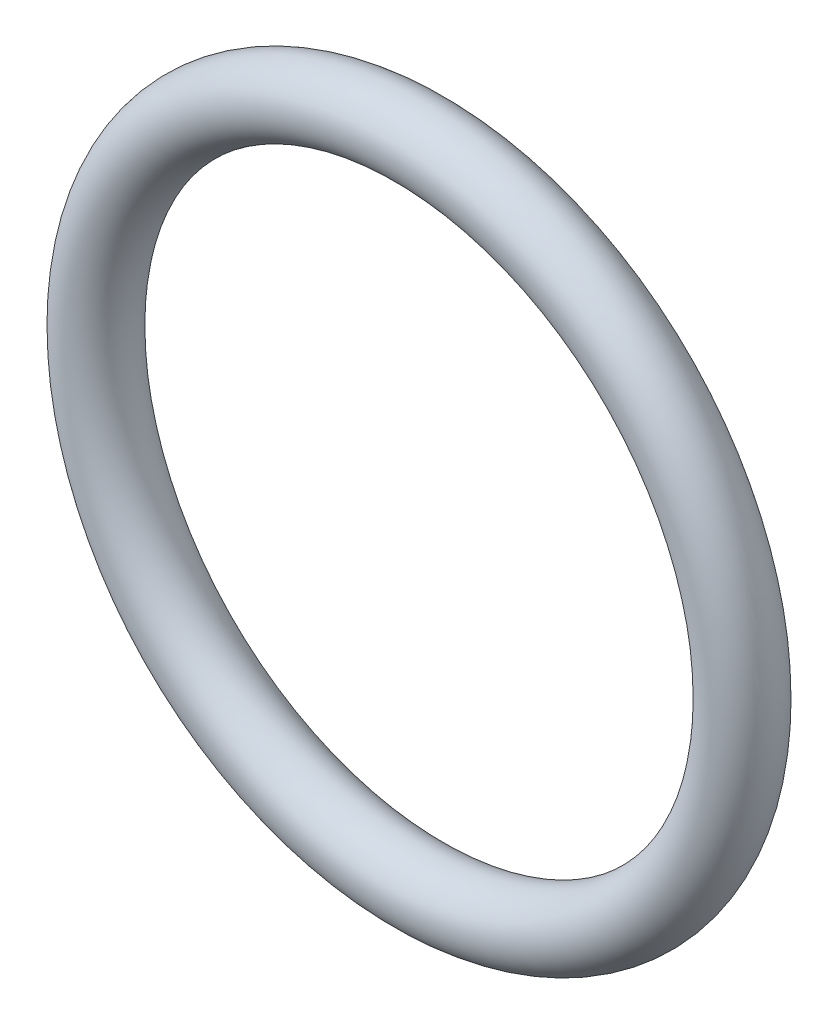
ISO-10303-21;
HEADER;
FILE_DESCRIPTION(('STEP AP214'),'2;1');
FILE_NAME('part.step','',(''),(''),'','','');
FILE_SCHEMA(('AUTOMOTIVE_DESIGN { 1 0 10303 214 1 1 1 1 }'));
ENDSEC;
DATA;
#1=APPLICATION_CONTEXT('core data for automotive mechanical design processes');
#2=APPLICATION_PROTOCOL_DEFINITION('international standard','automotive_design',2000,#1);
#3=PRODUCT_CONTEXT('',#1,'mechanical');
#4=PRODUCT('Part','Part','',(#3));
#5=PRODUCT_RELATED_PRODUCT_CATEGORY('part','',(#4));
#6=PRODUCT_DEFINITION_FORMATION('','',#4);
#7=PRODUCT_DEFINITION_CONTEXT('part definition',#1,'design');
#8=PRODUCT_DEFINITION('design','',#6,#7);
#9=PRODUCT_DEFINITION_SHAPE('','',#8);
#10=(LENGTH_UNIT() NAMED_UNIT(*) SI_UNIT(.MILLI.,.METRE.));
#11=(NAMED_UNIT(*) PLANE_ANGLE_UNIT() SI_UNIT($,.RADIAN.));
#12=(NAMED_UNIT(*) SI_UNIT($,.STERADIAN.) SOLID_ANGLE_UNIT());
#13=UNCERTAINTY_MEASURE_WITH_UNIT(LENGTH_MEASURE(1.E-05),#10,'distance_accuracy_value','');
#14=(GEOMETRIC_REPRESENTATION_CONTEXT(3) GLOBAL_UNCERTAINTY_ASSIGNED_CONTEXT((#13)) GLOBAL_UNIT_ASSIGNED_CONTEXT((#10,
#11,#12)) REPRESENTATION_CONTEXT('',''));
#15=CARTESIAN_POINT('',(0.,0.,0.));
#16=DIRECTION('',(0.,0.,1.));
#17=DIRECTION('',(1.,0.,0.));
#18=AXIS2_PLACEMENT_3D('',#15,#16,#17);
#19=CARTESIAN_POINT('',(0.,0.,0.));
#20=DIRECTION('',(0.,0.,1.));
#21=DIRECTION('',(1.,0.,0.));
#22=AXIS2_PLACEMENT_3D('',#19,#20,#21);
#23=TOROIDAL_SURFACE('',#22,14.,1.5);
#24=CARTESIAN_POINT('',(15.5,0.,0.));
#25=VERTEX_POINT('',#24);
#26=VERTEX_LOOP('',#25);
#27=FACE_BOUND('',#26,.T.);
#28=ADVANCED_FACE('F39',(#27),#23,.T.);
#29=CLOSED_SHELL('',(#28));
#30=MANIFOLD_SOLID_BREP('B2',#29);
#31=ADVANCED_BREP_SHAPE_REPRESENTATION('',(#18,#30),#14);
#32=SHAPE_DEFINITION_REPRESENTATION(#9,#31);
ENDSEC;
END-ISO-10303-21;
